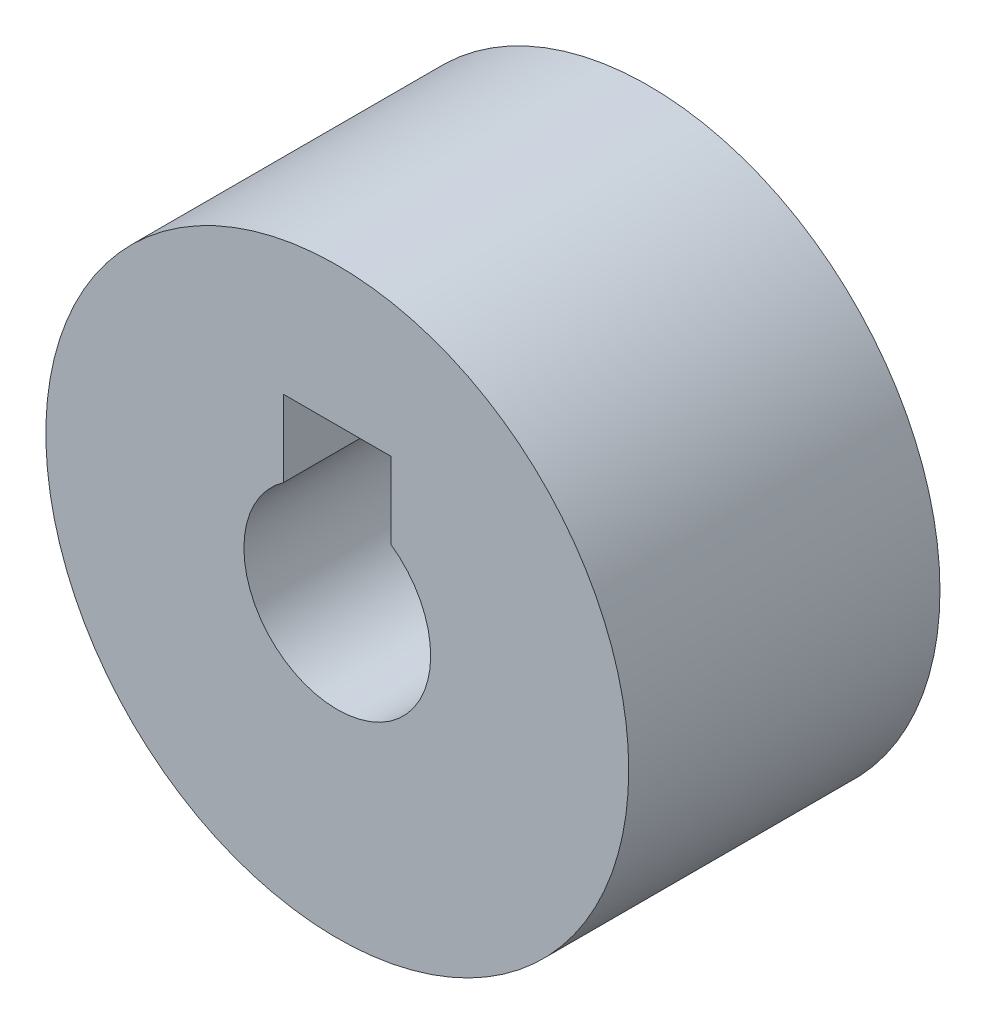
ISO-10303-21;
HEADER;
FILE_DESCRIPTION(('STEP AP214'),'2;1');
FILE_NAME('part.step','',(''),(''),'','','');
FILE_SCHEMA(('AUTOMOTIVE_DESIGN { 1 0 10303 214 1 1 1 1 }'));
ENDSEC;
DATA;
#1=APPLICATION_CONTEXT('core data for automotive mechanical design processes');
#2=APPLICATION_PROTOCOL_DEFINITION('international standard','automotive_design',2000,#1);
#3=PRODUCT_CONTEXT('',#1,'mechanical');
#4=PRODUCT('Part','Part','',(#3));
#5=PRODUCT_RELATED_PRODUCT_CATEGORY('part','',(#4));
#6=PRODUCT_DEFINITION_FORMATION('','',#4);
#7=PRODUCT_DEFINITION_CONTEXT('part definition',#1,'design');
#8=PRODUCT_DEFINITION('design','',#6,#7);
#9=PRODUCT_DEFINITION_SHAPE('','',#8);
#10=(LENGTH_UNIT() NAMED_UNIT(*) SI_UNIT(.MILLI.,.METRE.));
#11=(NAMED_UNIT(*) PLANE_ANGLE_UNIT() SI_UNIT($,.RADIAN.));
#12=(NAMED_UNIT(*) SI_UNIT($,.STERADIAN.) SOLID_ANGLE_UNIT());
#13=UNCERTAINTY_MEASURE_WITH_UNIT(LENGTH_MEASURE(1.E-05),#10,'distance_accuracy_value','');
#14=(GEOMETRIC_REPRESENTATION_CONTEXT(3) GLOBAL_UNCERTAINTY_ASSIGNED_CONTEXT((#13)) GLOBAL_UNIT_ASSIGNED_CONTEXT((#10,
#11,#12)) REPRESENTATION_CONTEXT('',''));
#15=CARTESIAN_POINT('',(0.,0.,0.));
#16=DIRECTION('',(0.,0.,1.));
#17=DIRECTION('',(1.,0.,0.));
#18=AXIS2_PLACEMENT_3D('',#15,#16,#17);
#19=CARTESIAN_POINT('',(0.,0.,-4.56992687385741));
#20=DIRECTION('',(0.,0.,1.));
#21=DIRECTION('',(1.,0.,0.));
#22=AXIS2_PLACEMENT_3D('',#19,#20,#21);
#23=PLANE('',#22);
#24=CARTESIAN_POINT('',(0.,0.,-4.56992687385741));
#25=DIRECTION('',(0.,0.,1.));
#26=DIRECTION('',(1.,0.,0.));
#27=AXIS2_PLACEMENT_3D('',#24,#25,#26);
#28=CIRCLE('',#27,5.15);
#29=CARTESIAN_POINT('',(5.15,0.,-4.56992687385741));
#30=VERTEX_POINT('',#29);
#31=EDGE_CURVE('E11',#30,#30,#28,.T.);
#32=ORIENTED_EDGE('',*,*,#31,.F.);
#33=EDGE_LOOP('',(#32));
#34=FACE_BOUND('',#33,.T.);
#35=DIRECTION('',(0.,1.,0.));
#36=VECTOR('',#35,1.);
#37=CARTESIAN_POINT('',(-0.95,0.,-4.56992687385741));
#38=LINE('',#37,#36);
#39=CARTESIAN_POINT('',(-0.95,1.3490737563232,-4.56992687385741));
#40=VERTEX_POINT('',#39);
#41=CARTESIAN_POINT('',(-0.95,2.7,-4.56992687385741));
#42=VERTEX_POINT('',#41);
#43=EDGE_CURVE('E56',#40,#42,#38,.T.);
#44=ORIENTED_EDGE('',*,*,#43,.F.);
#45=CARTESIAN_POINT('',(0.,0.,-4.56992687385741));
#46=DIRECTION('',(0.,0.,1.));
#47=DIRECTION('',(1.,0.,0.));
#48=AXIS2_PLACEMENT_3D('',#45,#46,#47);
#49=CIRCLE('',#48,1.65);
#50=CARTESIAN_POINT('',(0.95,1.3490737563232,-4.56992687385741));
#51=VERTEX_POINT('',#50);
#52=EDGE_CURVE('E45',#40,#51,#49,.T.);
#53=ORIENTED_EDGE('',*,*,#52,.T.);
#54=DIRECTION('',(0.,1.,0.));
#55=VECTOR('',#54,1.);
#56=CARTESIAN_POINT('',(0.95,0.,-4.56992687385741));
#57=LINE('',#56,#55);
#58=CARTESIAN_POINT('',(0.95,2.7,-4.56992687385741));
#59=VERTEX_POINT('',#58);
#60=EDGE_CURVE('E83',#51,#59,#57,.T.);
#61=ORIENTED_EDGE('',*,*,#60,.T.);
#62=DIRECTION('',(1.,0.,0.));
#63=VECTOR('',#62,1.);
#64=CARTESIAN_POINT('',(0.,2.7,-4.56992687385741));
#65=LINE('',#64,#63);
#66=EDGE_CURVE('E113',#42,#59,#65,.T.);
#67=ORIENTED_EDGE('',*,*,#66,.F.);
#68=EDGE_LOOP('',(#44,#53,#61,#67));
#69=FACE_BOUND('',#68,.T.);
#70=ADVANCED_FACE('F37',(#34,#69),#23,.F.);
#71=CARTESIAN_POINT('',(0.,0.,0.));
#72=DIRECTION('',(0.,0.,1.));
#73=DIRECTION('',(1.,0.,0.));
#74=AXIS2_PLACEMENT_3D('',#71,#72,#73);
#75=CYLINDRICAL_SURFACE('',#74,1.65);
#76=ORIENTED_EDGE('',*,*,#52,.F.);
#77=DIRECTION('',(0.,0.,1.));
#78=VECTOR('',#77,1.);
#79=CARTESIAN_POINT('',(-0.95,1.3490737563232,-5.56992687385741));
#80=LINE('',#79,#78);
#81=CARTESIAN_POINT('',(-0.95,1.3490737563232,0.930073126142594));
#82=VERTEX_POINT('',#81);
#83=EDGE_CURVE('E52',#40,#82,#80,.T.);
#84=ORIENTED_EDGE('',*,*,#83,.T.);
#85=CARTESIAN_POINT('',(0.,0.,0.930073126142594));
#86=DIRECTION('',(0.,0.,1.));
#87=DIRECTION('',(1.,0.,0.));
#88=AXIS2_PLACEMENT_3D('',#85,#86,#87);
#89=CIRCLE('',#88,1.65);
#90=CARTESIAN_POINT('',(0.95,1.3490737563232,0.930073126142594));
#91=VERTEX_POINT('',#90);
#92=EDGE_CURVE('E91',#91,#82,#89,.F.);
#93=ORIENTED_EDGE('',*,*,#92,.F.);
#94=DIRECTION('',(0.,0.,1.));
#95=VECTOR('',#94,1.);
#96=CARTESIAN_POINT('',(0.95,1.3490737563232,-5.56992687385741));
#97=LINE('',#96,#95);
#98=EDGE_CURVE('E76',#51,#91,#97,.T.);
#99=ORIENTED_EDGE('',*,*,#98,.F.);
#100=EDGE_LOOP('',(#76,#84,#93,#99));
#101=FACE_BOUND('',#100,.T.);
#102=ADVANCED_FACE('F92',(#101),#75,.F.);
#103=CARTESIAN_POINT('',(0.,0.,0.));
#104=DIRECTION('',(0.,0.,1.));
#105=DIRECTION('',(1.,0.,0.));
#106=AXIS2_PLACEMENT_3D('',#103,#104,#105);
#107=CYLINDRICAL_SURFACE('',#106,5.15);
#108=ORIENTED_EDGE('',*,*,#31,.T.);
#109=EDGE_LOOP('',(#108));
#110=FACE_BOUND('',#109,.T.);
#111=CARTESIAN_POINT('',(0.,0.,0.930073126142594));
#112=DIRECTION('',(0.,0.,1.));
#113=DIRECTION('',(1.,0.,0.));
#114=AXIS2_PLACEMENT_3D('',#111,#112,#113);
#115=CIRCLE('',#114,5.15);
#116=CARTESIAN_POINT('',(5.15,0.,0.930073126142594));
#117=VERTEX_POINT('',#116);
#118=EDGE_CURVE('E88',#117,#117,#115,.T.);
#119=ORIENTED_EDGE('',*,*,#118,.F.);
#120=EDGE_LOOP('',(#119));
#121=FACE_BOUND('',#120,.T.);
#122=ADVANCED_FACE('F39',(#110,#121),#107,.T.);
#123=CARTESIAN_POINT('',(-0.95,0.,-5.56992687385741));
#124=DIRECTION('',(1.,0.,0.));
#125=DIRECTION('',(0.,0.,-1.));
#126=AXIS2_PLACEMENT_3D('',#123,#124,#125);
#127=PLANE('',#126);
#128=ORIENTED_EDGE('',*,*,#43,.T.);
#129=DIRECTION('',(0.,0.,1.));
#130=VECTOR('',#129,1.);
#131=CARTESIAN_POINT('',(-0.95,2.7,-5.56992687385741));
#132=LINE('',#131,#130);
#133=CARTESIAN_POINT('',(-0.95,2.7,0.930073126142594));
#134=VERTEX_POINT('',#133);
#135=EDGE_CURVE('E109',#42,#134,#132,.T.);
#136=ORIENTED_EDGE('',*,*,#135,.T.);
#137=DIRECTION('',(0.,1.,0.));
#138=VECTOR('',#137,1.);
#139=CARTESIAN_POINT('',(-0.95,0.,0.930073126142594));
#140=LINE('',#139,#138);
#141=EDGE_CURVE('E95',#82,#134,#140,.T.);
#142=ORIENTED_EDGE('',*,*,#141,.F.);
#143=ORIENTED_EDGE('',*,*,#83,.F.);
#144=EDGE_LOOP('',(#128,#136,#142,#143));
#145=FACE_BOUND('',#144,.T.);
#146=ADVANCED_FACE('F119',(#145),#127,.T.);
#147=CARTESIAN_POINT('',(0.,2.7,-5.56992687385741));
#148=DIRECTION('',(0.,-1.,0.));
#149=DIRECTION('',(0.,0.,-1.));
#150=AXIS2_PLACEMENT_3D('',#147,#148,#149);
#151=PLANE('',#150);
#152=ORIENTED_EDGE('',*,*,#66,.T.);
#153=DIRECTION('',(0.,0.,1.));
#154=VECTOR('',#153,1.);
#155=CARTESIAN_POINT('',(0.95,2.7,-5.56992687385741));
#156=LINE('',#155,#154);
#157=CARTESIAN_POINT('',(0.95,2.7,0.930073126142594));
#158=VERTEX_POINT('',#157);
#159=EDGE_CURVE('E87',#59,#158,#156,.T.);
#160=ORIENTED_EDGE('',*,*,#159,.T.);
#161=DIRECTION('',(1.,0.,0.));
#162=VECTOR('',#161,1.);
#163=CARTESIAN_POINT('',(0.,2.7,0.930073126142594));
#164=LINE('',#163,#162);
#165=EDGE_CURVE('E101',#134,#158,#164,.T.);
#166=ORIENTED_EDGE('',*,*,#165,.F.);
#167=ORIENTED_EDGE('',*,*,#135,.F.);
#168=EDGE_LOOP('',(#152,#160,#166,#167));
#169=FACE_BOUND('',#168,.T.);
#170=ADVANCED_FACE('F118',(#169),#151,.T.);
#171=CARTESIAN_POINT('',(0.95,0.,-5.56992687385741));
#172=DIRECTION('',(1.,0.,0.));
#173=DIRECTION('',(0.,0.,-1.));
#174=AXIS2_PLACEMENT_3D('',#171,#172,#173);
#175=PLANE('',#174);
#176=ORIENTED_EDGE('',*,*,#98,.T.);
#177=DIRECTION('',(0.,-1.,0.));
#178=VECTOR('',#177,1.);
#179=CARTESIAN_POINT('',(0.95,0.,0.930073126142594));
#180=LINE('',#179,#178);
#181=EDGE_CURVE('E81',#158,#91,#180,.T.);
#182=ORIENTED_EDGE('',*,*,#181,.F.);
#183=ORIENTED_EDGE('',*,*,#159,.F.);
#184=ORIENTED_EDGE('',*,*,#60,.F.);
#185=EDGE_LOOP('',(#176,#182,#183,#184));
#186=FACE_BOUND('',#185,.T.);
#187=ADVANCED_FACE('F78',(#186),#175,.F.);
#188=CARTESIAN_POINT('',(0.,0.,0.930073126142594));
#189=DIRECTION('',(0.,0.,1.));
#190=DIRECTION('',(1.,0.,0.));
#191=AXIS2_PLACEMENT_3D('',#188,#189,#190);
#192=PLANE('',#191);
#193=ORIENTED_EDGE('',*,*,#181,.T.);
#194=ORIENTED_EDGE('',*,*,#92,.T.);
#195=ORIENTED_EDGE('',*,*,#141,.T.);
#196=ORIENTED_EDGE('',*,*,#165,.T.);
#197=EDGE_LOOP('',(#193,#194,#195,#196));
#198=FACE_BOUND('',#197,.T.);
#199=ORIENTED_EDGE('',*,*,#118,.T.);
#200=EDGE_LOOP('',(#199));
#201=FACE_BOUND('',#200,.T.);
#202=ADVANCED_FACE('F98',(#198,#201),#192,.T.);
#203=CLOSED_SHELL('',(#70,#102,#122,#146,#170,#187,#202));
#204=MANIFOLD_SOLID_BREP('B2',#203);
#205=ADVANCED_BREP_SHAPE_REPRESENTATION('',(#18,#204),#14);
#206=SHAPE_DEFINITION_REPRESENTATION(#9,#205);
ENDSEC;
END-ISO-10303-21;
